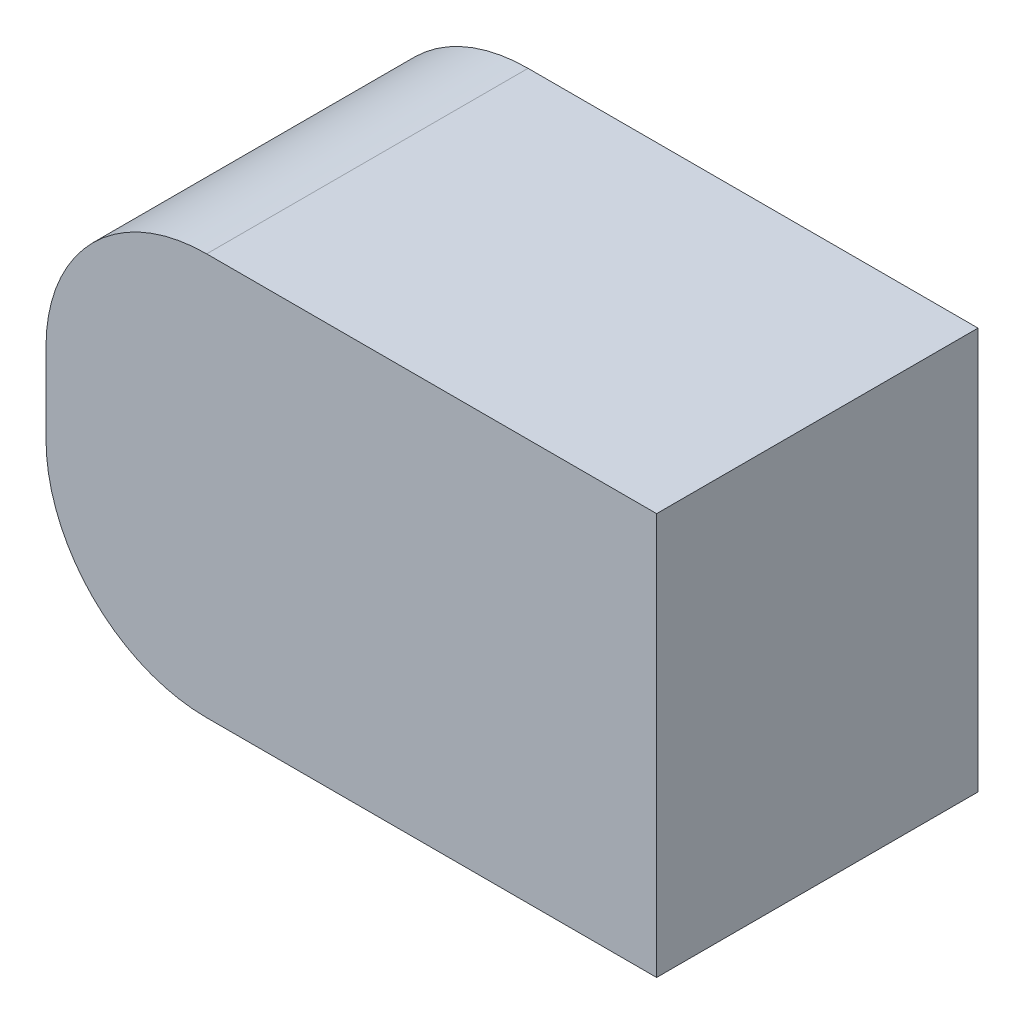
ISO-10303-21;
HEADER;
FILE_DESCRIPTION(('STEP AP214'),'2;1');
FILE_NAME('part.step','',(''),(''),'','','');
FILE_SCHEMA(('AUTOMOTIVE_DESIGN { 1 0 10303 214 1 1 1 1 }'));
ENDSEC;
DATA;
#1=APPLICATION_CONTEXT('core data for automotive mechanical design processes');
#2=APPLICATION_PROTOCOL_DEFINITION('international standard','automotive_design',2000,#1);
#3=PRODUCT_CONTEXT('',#1,'mechanical');
#4=PRODUCT('Part','Part','',(#3));
#5=PRODUCT_RELATED_PRODUCT_CATEGORY('part','',(#4));
#6=PRODUCT_DEFINITION_FORMATION('','',#4);
#7=PRODUCT_DEFINITION_CONTEXT('part definition',#1,'design');
#8=PRODUCT_DEFINITION('design','',#6,#7);
#9=PRODUCT_DEFINITION_SHAPE('','',#8);
#10=(LENGTH_UNIT() NAMED_UNIT(*) SI_UNIT(.MILLI.,.METRE.));
#11=(NAMED_UNIT(*) PLANE_ANGLE_UNIT() SI_UNIT($,.RADIAN.));
#12=(NAMED_UNIT(*) SI_UNIT($,.STERADIAN.) SOLID_ANGLE_UNIT());
#13=UNCERTAINTY_MEASURE_WITH_UNIT(LENGTH_MEASURE(1.E-05),#10,'distance_accuracy_value','');
#14=(GEOMETRIC_REPRESENTATION_CONTEXT(3) GLOBAL_UNCERTAINTY_ASSIGNED_CONTEXT((#13)) GLOBAL_UNIT_ASSIGNED_CONTEXT((#10,
#11,#12)) REPRESENTATION_CONTEXT('',''));
#15=CARTESIAN_POINT('',(0.,0.,0.));
#16=DIRECTION('',(0.,0.,1.));
#17=DIRECTION('',(1.,0.,0.));
#18=AXIS2_PLACEMENT_3D('',#15,#16,#17);
#19=CARTESIAN_POINT('',(1.223,0.0249999999999996,0.));
#20=DIRECTION('',(0.,0.,-1.));
#21=DIRECTION('',(-0.707106781186548,0.707106781186547,0.));
#22=AXIS2_PLACEMENT_3D('',#19,#20,#21);
#23=CYLINDRICAL_SURFACE('',#22,0.1);
#24=CARTESIAN_POINT('',(1.223,0.0249999999999996,0.2));
#25=DIRECTION('',(0.,0.,1.));
#26=DIRECTION('',(-0.707106781186548,0.707106781186547,0.));
#27=AXIS2_PLACEMENT_3D('',#24,#25,#26);
#28=CIRCLE('',#27,0.1);
#29=CARTESIAN_POINT('',(1.223,0.125,0.2));
#30=VERTEX_POINT('',#29);
#31=CARTESIAN_POINT('',(1.123,0.0249999999999996,0.2));
#32=VERTEX_POINT('',#31);
#33=EDGE_CURVE('E11',#30,#32,#28,.T.);
#34=ORIENTED_EDGE('',*,*,#33,.F.);
#35=DIRECTION('',(0.,0.,1.));
#36=VECTOR('',#35,1.);
#37=CARTESIAN_POINT('',(1.223,0.125,0.));
#38=LINE('',#37,#36);
#39=CARTESIAN_POINT('',(1.223,0.125,0.));
#40=VERTEX_POINT('',#39);
#41=EDGE_CURVE('E24',#40,#30,#38,.T.);
#42=ORIENTED_EDGE('',*,*,#41,.F.);
#43=CARTESIAN_POINT('',(1.223,0.0249999999999996,0.));
#44=DIRECTION('',(0.,0.,-1.));
#45=DIRECTION('',(-0.707106781186548,0.707106781186547,0.));
#46=AXIS2_PLACEMENT_3D('',#43,#44,#45);
#47=CIRCLE('',#46,0.1);
#48=CARTESIAN_POINT('',(1.123,0.0249999999999996,0.));
#49=VERTEX_POINT('',#48);
#50=EDGE_CURVE('E114',#49,#40,#47,.T.);
#51=ORIENTED_EDGE('',*,*,#50,.F.);
#52=DIRECTION('',(0.,0.,-1.));
#53=VECTOR('',#52,1.);
#54=CARTESIAN_POINT('',(1.123,0.0249999999999996,0.));
#55=LINE('',#54,#53);
#56=EDGE_CURVE('E111',#32,#49,#55,.T.);
#57=ORIENTED_EDGE('',*,*,#56,.F.);
#58=EDGE_LOOP('',(#34,#42,#51,#57));
#59=FACE_BOUND('',#58,.T.);
#60=ADVANCED_FACE('F17',(#59),#23,.T.);
#61=CARTESIAN_POINT('',(1.313,0.,0.));
#62=DIRECTION('',(0.,0.,-1.));
#63=DIRECTION('',(-1.,0.,0.));
#64=AXIS2_PLACEMENT_3D('',#61,#62,#63);
#65=PLANE('',#64);
#66=ORIENTED_EDGE('',*,*,#50,.T.);
#67=DIRECTION('',(1.,0.,0.));
#68=VECTOR('',#67,1.);
#69=CARTESIAN_POINT('',(1.123,0.125,0.));
#70=LINE('',#69,#68);
#71=CARTESIAN_POINT('',(1.503,0.125,0.));
#72=VERTEX_POINT('',#71);
#73=EDGE_CURVE('E109',#40,#72,#70,.T.);
#74=ORIENTED_EDGE('',*,*,#73,.T.);
#75=DIRECTION('',(0.,-1.,0.));
#76=VECTOR('',#75,1.);
#77=CARTESIAN_POINT('',(1.503,0.125,0.));
#78=LINE('',#77,#76);
#79=CARTESIAN_POINT('',(1.503,-0.125,0.));
#80=VERTEX_POINT('',#79);
#81=EDGE_CURVE('E107',#72,#80,#78,.T.);
#82=ORIENTED_EDGE('',*,*,#81,.T.);
#83=DIRECTION('',(-1.,0.,0.));
#84=VECTOR('',#83,1.);
#85=CARTESIAN_POINT('',(1.503,-0.125,0.));
#86=LINE('',#85,#84);
#87=CARTESIAN_POINT('',(1.223,-0.124999999999986,0.));
#88=VERTEX_POINT('',#87);
#89=EDGE_CURVE('E72',#80,#88,#86,.T.);
#90=ORIENTED_EDGE('',*,*,#89,.T.);
#91=CARTESIAN_POINT('',(1.223,-0.0249999999999859,0.));
#92=DIRECTION('',(0.,0.,-1.));
#93=DIRECTION('',(-0.707106781186565,-0.70710678118653,0.));
#94=AXIS2_PLACEMENT_3D('',#91,#92,#93);
#95=CIRCLE('',#94,0.1);
#96=CARTESIAN_POINT('',(1.123,-0.0249999999999859,0.));
#97=VERTEX_POINT('',#96);
#98=EDGE_CURVE('E104',#88,#97,#95,.T.);
#99=ORIENTED_EDGE('',*,*,#98,.T.);
#100=DIRECTION('',(0.,1.,0.));
#101=VECTOR('',#100,1.);
#102=CARTESIAN_POINT('',(1.123,-0.125,0.));
#103=LINE('',#102,#101);
#104=EDGE_CURVE('E101',#97,#49,#103,.T.);
#105=ORIENTED_EDGE('',*,*,#104,.T.);
#106=EDGE_LOOP('',(#66,#74,#82,#90,#99,#105));
#107=FACE_BOUND('',#106,.T.);
#108=ADVANCED_FACE('F120',(#107),#65,.T.);
#109=CARTESIAN_POINT('',(1.123,-0.125,0.));
#110=DIRECTION('',(1.,0.,0.));
#111=DIRECTION('',(0.,1.,0.));
#112=AXIS2_PLACEMENT_3D('',#109,#110,#111);
#113=PLANE('',#112);
#114=ORIENTED_EDGE('',*,*,#56,.T.);
#115=ORIENTED_EDGE('',*,*,#104,.F.);
#116=DIRECTION('',(0.,0.,1.));
#117=VECTOR('',#116,1.);
#118=CARTESIAN_POINT('',(1.123,-0.0249999999999859,0.));
#119=LINE('',#118,#117);
#120=CARTESIAN_POINT('',(1.123,-0.0249999999999859,0.2));
#121=VERTEX_POINT('',#120);
#122=EDGE_CURVE('E99',#97,#121,#119,.T.);
#123=ORIENTED_EDGE('',*,*,#122,.T.);
#124=DIRECTION('',(0.,1.,0.));
#125=VECTOR('',#124,1.);
#126=CARTESIAN_POINT('',(1.123,-0.125,0.2));
#127=LINE('',#126,#125);
#128=EDGE_CURVE('E96',#121,#32,#127,.T.);
#129=ORIENTED_EDGE('',*,*,#128,.T.);
#130=EDGE_LOOP('',(#114,#115,#123,#129));
#131=FACE_BOUND('',#130,.T.);
#132=ADVANCED_FACE('F125',(#131),#113,.F.);
#133=CARTESIAN_POINT('',(1.223,-0.0249999999999859,0.));
#134=DIRECTION('',(0.,0.,-1.));
#135=DIRECTION('',(-0.707106781186565,-0.70710678118653,0.));
#136=AXIS2_PLACEMENT_3D('',#133,#134,#135);
#137=CYLINDRICAL_SURFACE('',#136,0.1);
#138=CARTESIAN_POINT('',(1.223,-0.0249999999999859,0.2));
#139=DIRECTION('',(0.,0.,1.));
#140=DIRECTION('',(-0.707106781186565,-0.70710678118653,0.));
#141=AXIS2_PLACEMENT_3D('',#138,#139,#140);
#142=CIRCLE('',#141,0.1);
#143=CARTESIAN_POINT('',(1.223,-0.124999999999986,0.2));
#144=VERTEX_POINT('',#143);
#145=EDGE_CURVE('E82',#121,#144,#142,.T.);
#146=ORIENTED_EDGE('',*,*,#145,.F.);
#147=ORIENTED_EDGE('',*,*,#122,.F.);
#148=ORIENTED_EDGE('',*,*,#98,.F.);
#149=DIRECTION('',(0.,0.,-1.));
#150=VECTOR('',#149,1.);
#151=CARTESIAN_POINT('',(1.223,-0.124999999999986,0.));
#152=LINE('',#151,#150);
#153=EDGE_CURVE('E93',#144,#88,#152,.T.);
#154=ORIENTED_EDGE('',*,*,#153,.F.);
#155=EDGE_LOOP('',(#146,#147,#148,#154));
#156=FACE_BOUND('',#155,.T.);
#157=ADVANCED_FACE('F127',(#156),#137,.T.);
#158=CARTESIAN_POINT('',(1.123,0.125,0.));
#159=DIRECTION('',(0.,-1.,0.));
#160=DIRECTION('',(1.,0.,0.));
#161=AXIS2_PLACEMENT_3D('',#158,#159,#160);
#162=PLANE('',#161);
#163=ORIENTED_EDGE('',*,*,#41,.T.);
#164=DIRECTION('',(1.,0.,0.));
#165=VECTOR('',#164,1.);
#166=CARTESIAN_POINT('',(1.123,0.125,0.2));
#167=LINE('',#166,#165);
#168=CARTESIAN_POINT('',(1.503,0.125,0.2));
#169=VERTEX_POINT('',#168);
#170=EDGE_CURVE('E91',#30,#169,#167,.T.);
#171=ORIENTED_EDGE('',*,*,#170,.T.);
#172=DIRECTION('',(0.,0.,1.));
#173=VECTOR('',#172,1.);
#174=CARTESIAN_POINT('',(1.503,0.125,0.));
#175=LINE('',#174,#173);
#176=EDGE_CURVE('E76',#72,#169,#175,.T.);
#177=ORIENTED_EDGE('',*,*,#176,.F.);
#178=ORIENTED_EDGE('',*,*,#73,.F.);
#179=EDGE_LOOP('',(#163,#171,#177,#178));
#180=FACE_BOUND('',#179,.T.);
#181=ADVANCED_FACE('F118',(#180),#162,.F.);
#182=CARTESIAN_POINT('',(1.503,-0.125,0.));
#183=DIRECTION('',(0.,1.,0.));
#184=DIRECTION('',(-1.,0.,0.));
#185=AXIS2_PLACEMENT_3D('',#182,#183,#184);
#186=PLANE('',#185);
#187=ORIENTED_EDGE('',*,*,#153,.T.);
#188=ORIENTED_EDGE('',*,*,#89,.F.);
#189=DIRECTION('',(0.,0.,1.));
#190=VECTOR('',#189,1.);
#191=CARTESIAN_POINT('',(1.503,-0.125,0.));
#192=LINE('',#191,#190);
#193=CARTESIAN_POINT('',(1.503,-0.125,0.2));
#194=VERTEX_POINT('',#193);
#195=EDGE_CURVE('E67',#80,#194,#192,.T.);
#196=ORIENTED_EDGE('',*,*,#195,.T.);
#197=DIRECTION('',(-1.,0.,0.));
#198=VECTOR('',#197,1.);
#199=CARTESIAN_POINT('',(1.503,-0.125,0.2));
#200=LINE('',#199,#198);
#201=EDGE_CURVE('E71',#194,#144,#200,.T.);
#202=ORIENTED_EDGE('',*,*,#201,.T.);
#203=EDGE_LOOP('',(#187,#188,#196,#202));
#204=FACE_BOUND('',#203,.T.);
#205=ADVANCED_FACE('F70',(#204),#186,.F.);
#206=CARTESIAN_POINT('',(1.503,0.125,0.));
#207=DIRECTION('',(-1.,0.,0.));
#208=DIRECTION('',(0.,-1.,0.));
#209=AXIS2_PLACEMENT_3D('',#206,#207,#208);
#210=PLANE('',#209);
#211=ORIENTED_EDGE('',*,*,#81,.F.);
#212=ORIENTED_EDGE('',*,*,#176,.T.);
#213=DIRECTION('',(0.,-1.,0.));
#214=VECTOR('',#213,1.);
#215=CARTESIAN_POINT('',(1.503,0.125,0.2));
#216=LINE('',#215,#214);
#217=EDGE_CURVE('E80',#169,#194,#216,.T.);
#218=ORIENTED_EDGE('',*,*,#217,.T.);
#219=ORIENTED_EDGE('',*,*,#195,.F.);
#220=EDGE_LOOP('',(#211,#212,#218,#219));
#221=FACE_BOUND('',#220,.T.);
#222=ADVANCED_FACE('F86',(#221),#210,.F.);
#223=CARTESIAN_POINT('',(1.313,0.,0.2));
#224=DIRECTION('',(0.,0.,-1.));
#225=DIRECTION('',(-1.,0.,0.));
#226=AXIS2_PLACEMENT_3D('',#223,#224,#225);
#227=PLANE('',#226);
#228=ORIENTED_EDGE('',*,*,#33,.T.);
#229=ORIENTED_EDGE('',*,*,#128,.F.);
#230=ORIENTED_EDGE('',*,*,#145,.T.);
#231=ORIENTED_EDGE('',*,*,#201,.F.);
#232=ORIENTED_EDGE('',*,*,#217,.F.);
#233=ORIENTED_EDGE('',*,*,#170,.F.);
#234=EDGE_LOOP('',(#228,#229,#230,#231,#232,#233));
#235=FACE_BOUND('',#234,.T.);
#236=ADVANCED_FACE('F79',(#235),#227,.F.);
#237=CLOSED_SHELL('',(#60,#108,#132,#157,#181,#205,#222,#236));
#238=MANIFOLD_SOLID_BREP('B1',#237);
#239=ADVANCED_BREP_SHAPE_REPRESENTATION('',(#18,#238),#14);
#240=SHAPE_DEFINITION_REPRESENTATION(#9,#239);
ENDSEC;
END-ISO-10303-21;
